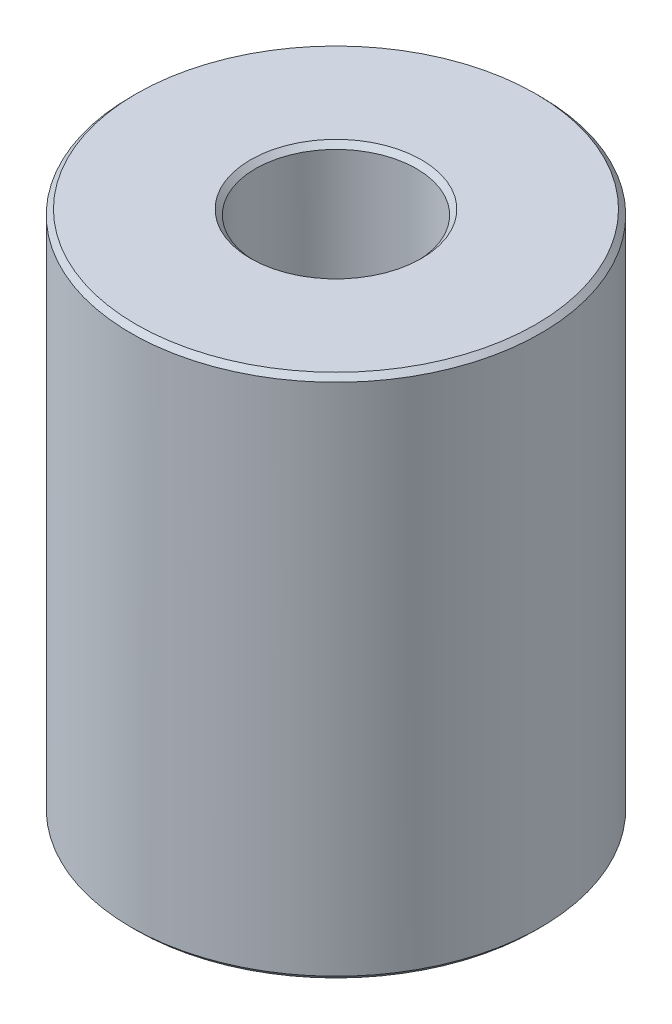
ISO-10303-21;
HEADER;
FILE_DESCRIPTION(('STEP AP214'),'2;1');
FILE_NAME('part.step','',(''),(''),'','','');
FILE_SCHEMA(('AUTOMOTIVE_DESIGN { 1 0 10303 214 1 1 1 1 }'));
ENDSEC;
DATA;
#1=APPLICATION_CONTEXT('core data for automotive mechanical design processes');
#2=APPLICATION_PROTOCOL_DEFINITION('international standard','automotive_design',2000,#1);
#3=PRODUCT_CONTEXT('',#1,'mechanical');
#4=PRODUCT('Part','Part','',(#3));
#5=PRODUCT_RELATED_PRODUCT_CATEGORY('part','',(#4));
#6=PRODUCT_DEFINITION_FORMATION('','',#4);
#7=PRODUCT_DEFINITION_CONTEXT('part definition',#1,'design');
#8=PRODUCT_DEFINITION('design','',#6,#7);
#9=PRODUCT_DEFINITION_SHAPE('','',#8);
#10=(LENGTH_UNIT() NAMED_UNIT(*) SI_UNIT(.MILLI.,.METRE.));
#11=(NAMED_UNIT(*) PLANE_ANGLE_UNIT() SI_UNIT($,.RADIAN.));
#12=(NAMED_UNIT(*) SI_UNIT($,.STERADIAN.) SOLID_ANGLE_UNIT());
#13=UNCERTAINTY_MEASURE_WITH_UNIT(LENGTH_MEASURE(1.E-05),#10,'distance_accuracy_value','');
#14=(GEOMETRIC_REPRESENTATION_CONTEXT(3) GLOBAL_UNCERTAINTY_ASSIGNED_CONTEXT((#13)) GLOBAL_UNIT_ASSIGNED_CONTEXT((#10,
#11,#12)) REPRESENTATION_CONTEXT('',''));
#15=CARTESIAN_POINT('',(0.,0.,0.));
#16=DIRECTION('',(0.,0.,1.));
#17=DIRECTION('',(1.,0.,0.));
#18=AXIS2_PLACEMENT_3D('',#15,#16,#17);
#19=CARTESIAN_POINT('',(0.,147.217348148467,0.));
#20=DIRECTION('',(0.,-1.,0.));
#21=DIRECTION('',(0.,0.,-1.));
#22=AXIS2_PLACEMENT_3D('',#19,#20,#21);
#23=CYLINDRICAL_SURFACE('',#22,57.5);
#24=CARTESIAN_POINT('',(0.,1.43097935988024,0.));
#25=DIRECTION('',(0.,1.,0.));
#26=DIRECTION('',(0.,0.,1.));
#27=AXIS2_PLACEMENT_3D('',#24,#25,#26);
#28=CIRCLE('',#27,57.5);
#29=CARTESIAN_POINT('',(0.,1.43097935988024,57.5));
#30=VERTEX_POINT('',#29);
#31=EDGE_CURVE('E10',#30,#30,#28,.T.);
#32=ORIENTED_EDGE('',*,*,#31,.T.);
#33=EDGE_LOOP('',(#32));
#34=FACE_BOUND('',#33,.T.);
#35=CARTESIAN_POINT('',(0.,145.786368788587,0.));
#36=DIRECTION('',(0.,1.,0.));
#37=DIRECTION('',(0.,0.,1.));
#38=AXIS2_PLACEMENT_3D('',#35,#36,#37);
#39=CIRCLE('',#38,57.5);
#40=CARTESIAN_POINT('',(0.,145.786368788587,-57.5));
#41=VERTEX_POINT('',#40);
#42=EDGE_CURVE('E50',#41,#41,#39,.F.);
#43=ORIENTED_EDGE('',*,*,#42,.T.);
#44=EDGE_LOOP('',(#43));
#45=FACE_BOUND('',#44,.T.);
#46=ADVANCED_FACE('F39',(#34,#45),#23,.T.);
#47=CARTESIAN_POINT('',(0.,147.217348148467,0.));
#48=DIRECTION('',(0.,1.,0.));
#49=DIRECTION('',(0.,0.,1.));
#50=AXIS2_PLACEMENT_3D('',#47,#48,#49);
#51=PLANE('',#50);
#52=CARTESIAN_POINT('',(0.,147.217348148467,0.));
#53=DIRECTION('',(0.,1.,0.));
#54=DIRECTION('',(0.,0.,1.));
#55=AXIS2_PLACEMENT_3D('',#52,#53,#54);
#56=CIRCLE('',#55,23.9984481929716);
#57=CARTESIAN_POINT('',(0.,147.217348148467,23.9984481929716));
#58=VERTEX_POINT('',#57);
#59=EDGE_CURVE('E58',#58,#58,#56,.F.);
#60=ORIENTED_EDGE('',*,*,#59,.T.);
#61=EDGE_LOOP('',(#60));
#62=FACE_BOUND('',#61,.T.);
#63=CARTESIAN_POINT('',(0.,147.217348148467,0.));
#64=DIRECTION('',(0.,1.,0.));
#65=DIRECTION('',(0.,0.,1.));
#66=AXIS2_PLACEMENT_3D('',#63,#64,#65);
#67=CIRCLE('',#66,56.0690206401197);
#68=CARTESIAN_POINT('',(0.,147.217348148467,-56.0690206401197));
#69=VERTEX_POINT('',#68);
#70=EDGE_CURVE('E61',#69,#69,#67,.T.);
#71=ORIENTED_EDGE('',*,*,#70,.T.);
#72=EDGE_LOOP('',(#71));
#73=FACE_BOUND('',#72,.T.);
#74=ADVANCED_FACE('F88',(#62,#73),#51,.T.);
#75=CARTESIAN_POINT('',(0.,0.,0.));
#76=DIRECTION('',(0.,1.,0.));
#77=DIRECTION('',(0.,0.,1.));
#78=AXIS2_PLACEMENT_3D('',#75,#76,#77);
#79=PLANE('',#78);
#80=CARTESIAN_POINT('',(0.,0.,0.));
#81=DIRECTION('',(0.,1.,0.));
#82=DIRECTION('',(0.,0.,1.));
#83=AXIS2_PLACEMENT_3D('',#80,#81,#82);
#84=CIRCLE('',#83,23.9984481929716);
#85=CARTESIAN_POINT('',(0.,0.,-23.9984481929716));
#86=VERTEX_POINT('',#85);
#87=EDGE_CURVE('E51',#86,#86,#84,.T.);
#88=ORIENTED_EDGE('',*,*,#87,.T.);
#89=EDGE_LOOP('',(#88));
#90=FACE_BOUND('',#89,.T.);
#91=CARTESIAN_POINT('',(0.,0.,0.));
#92=DIRECTION('',(0.,1.,0.));
#93=DIRECTION('',(0.,0.,1.));
#94=AXIS2_PLACEMENT_3D('',#91,#92,#93);
#95=CIRCLE('',#94,56.0690206401198);
#96=CARTESIAN_POINT('',(0.,0.,56.0690206401198));
#97=VERTEX_POINT('',#96);
#98=EDGE_CURVE('E54',#97,#97,#95,.F.);
#99=ORIENTED_EDGE('',*,*,#98,.T.);
#100=EDGE_LOOP('',(#99));
#101=FACE_BOUND('',#100,.T.);
#102=ADVANCED_FACE('F83',(#90,#101),#79,.F.);
#103=CARTESIAN_POINT('',(0.,147.217348148467,0.));
#104=DIRECTION('',(0.,-1.,0.));
#105=DIRECTION('',(0.,0.,-1.));
#106=AXIS2_PLACEMENT_3D('',#103,#104,#105);
#107=CYLINDRICAL_SURFACE('',#106,22.5674688330913);
#108=CARTESIAN_POINT('',(0.,145.786368788587,0.));
#109=DIRECTION('',(0.,1.,0.));
#110=DIRECTION('',(0.,0.,1.));
#111=AXIS2_PLACEMENT_3D('',#108,#109,#110);
#112=CIRCLE('',#111,22.5674688330913);
#113=CARTESIAN_POINT('',(0.,145.786368788587,22.5674688330913));
#114=VERTEX_POINT('',#113);
#115=EDGE_CURVE('E67',#114,#114,#112,.T.);
#116=ORIENTED_EDGE('',*,*,#115,.T.);
#117=EDGE_LOOP('',(#116));
#118=FACE_BOUND('',#117,.T.);
#119=CARTESIAN_POINT('',(0.,1.43097935988026,0.));
#120=DIRECTION('',(0.,1.,0.));
#121=DIRECTION('',(0.,0.,1.));
#122=AXIS2_PLACEMENT_3D('',#119,#120,#121);
#123=CIRCLE('',#122,22.5674688330913);
#124=CARTESIAN_POINT('',(0.,1.43097935988026,-22.5674688330913));
#125=VERTEX_POINT('',#124);
#126=EDGE_CURVE('E69',#125,#125,#123,.F.);
#127=ORIENTED_EDGE('',*,*,#126,.T.);
#128=EDGE_LOOP('',(#127));
#129=FACE_BOUND('',#128,.T.);
#130=ADVANCED_FACE('F71',(#118,#129),#107,.F.);
#131=CARTESIAN_POINT('',(0.,145.786368788587,0.));
#132=DIRECTION('',(0.,1.,0.));
#133=DIRECTION('',(0.,0.,1.));
#134=AXIS2_PLACEMENT_3D('',#131,#132,#133);
#135=CONICAL_SURFACE('',#134,22.5674688330913,0.785398163397448);
#136=ORIENTED_EDGE('',*,*,#59,.F.);
#137=EDGE_LOOP('',(#136));
#138=FACE_BOUND('',#137,.T.);
#139=ORIENTED_EDGE('',*,*,#115,.F.);
#140=EDGE_LOOP('',(#139));
#141=FACE_BOUND('',#140,.T.);
#142=ADVANCED_FACE('F77',(#138,#141),#135,.F.);
#143=CARTESIAN_POINT('',(0.,0.,0.));
#144=DIRECTION('',(0.,-1.,0.));
#145=DIRECTION('',(0.,0.,-1.));
#146=AXIS2_PLACEMENT_3D('',#143,#144,#145);
#147=CONICAL_SURFACE('',#146,23.9984481929716,0.78539816339745);
#148=CARTESIAN_POINT('',(0.,1.43097935988026,-22.5674688330913));
#149=CARTESIAN_POINT('',(0.,1.41607332488151,-22.58237486809));
#150=CARTESIAN_POINT('',(0.,1.40116728988276,-22.5972809030888));
#151=CARTESIAN_POINT('',(0.,1.37135521988525,-22.6270929730863));
#152=CARTESIAN_POINT('',(0.,1.3564491848865,-22.6419990080851));
#153=CARTESIAN_POINT('',(0.,1.32663711488899,-22.6718110780826));
#154=CARTESIAN_POINT('',(0.,1.31173107989024,-22.6867171130813));
#155=CARTESIAN_POINT('',(0.,1.28191900989274,-22.7165291830788));
#156=CARTESIAN_POINT('',(0.,1.26701297489398,-22.7314352180776));
#157=CARTESIAN_POINT('',(0.,1.23720090489648,-22.7612472880751));
#158=CARTESIAN_POINT('',(0.,1.22229486989772,-22.7761533230738));
#159=CARTESIAN_POINT('',(0.,1.19248279990022,-22.8059653930713));
#160=CARTESIAN_POINT('',(0.,1.17757676490147,-22.8208714280701));
#161=CARTESIAN_POINT('',(0.,1.14776469490396,-22.8506834980676));
#162=CARTESIAN_POINT('',(0.,1.13285865990521,-22.8655895330664));
#163=CARTESIAN_POINT('',(0.,1.1030465899077,-22.8954016030639));
#164=CARTESIAN_POINT('',(0.,1.08814055490895,-22.9103076380626));
#165=CARTESIAN_POINT('',(0.,1.05832848491144,-22.9401197080601));
#166=CARTESIAN_POINT('',(0.,1.04342244991269,-22.9550257430589));
#167=CARTESIAN_POINT('',(0.,1.01361037991519,-22.9848378130564));
#168=CARTESIAN_POINT('',(0.,0.998704344916434,-22.9997438480551));
#169=CARTESIAN_POINT('',(0.,0.968892274918928,-23.0295559180526));
#170=CARTESIAN_POINT('',(0.,0.953986239920176,-23.0444619530514));
#171=CARTESIAN_POINT('',(0.,0.92417416992267,-23.0742740230489));
#172=CARTESIAN_POINT('',(0.,0.909268134923917,-23.0891800580476));
#173=CARTESIAN_POINT('',(0.,0.879456064926411,-23.1189921280452));
#174=CARTESIAN_POINT('',(0.,0.864550029927659,-23.1338981630439));
#175=CARTESIAN_POINT('',(0.,0.834737959930154,-23.1637102330414));
#176=CARTESIAN_POINT('',(0.,0.819831924931401,-23.1786162680402));
#177=CARTESIAN_POINT('',(0.,0.790019854933895,-23.2084283380377));
#178=CARTESIAN_POINT('',(0.,0.775113819935143,-23.2233343730364));
#179=CARTESIAN_POINT('',(0.,0.745301749937637,-23.2531464430339));
#180=CARTESIAN_POINT('',(0.,0.730395714938884,-23.2680524780327));
#181=CARTESIAN_POINT('',(0.,0.700583644941379,-23.2978645480302));
#182=CARTESIAN_POINT('',(0.,0.685677609942626,-23.3127705830289));
#183=CARTESIAN_POINT('',(0.,0.655865539945121,-23.3425826530264));
#184=CARTESIAN_POINT('',(0.,0.640959504946368,-23.3574886880252));
#185=CARTESIAN_POINT('',(0.,0.611147434948862,-23.3873007580227));
#186=CARTESIAN_POINT('',(0.,0.596241399950109,-23.4022067930215));
#187=CARTESIAN_POINT('',(0.,0.566429329952604,-23.432018863019));
#188=CARTESIAN_POINT('',(0.,0.551523294953852,-23.4469248980177));
#189=CARTESIAN_POINT('',(0.,0.521711224956346,-23.4767369680152));
#190=CARTESIAN_POINT('',(0.,0.506805189957593,-23.491643003014));
#191=CARTESIAN_POINT('',(0.,0.476993119960088,-23.5214550730115));
#192=CARTESIAN_POINT('',(0.,0.462087084961335,-23.5363611080102));
#193=CARTESIAN_POINT('',(0.,0.432275014963829,-23.5661731780077));
#194=CARTESIAN_POINT('',(0.,0.417368979965076,-23.5810792130065));
#195=CARTESIAN_POINT('',(0.,0.387556909967571,-23.610891283004));
#196=CARTESIAN_POINT('',(0.,0.372650874968819,-23.6257973180027));
#197=CARTESIAN_POINT('',(0.,0.342838804971313,-23.6556093880003));
#198=CARTESIAN_POINT('',(0.,0.32793276997256,-23.670515422999));
#199=CARTESIAN_POINT('',(0.,0.298120699975055,-23.7003274929965));
#200=CARTESIAN_POINT('',(0.,0.283214664976302,-23.7152335279953));
#201=CARTESIAN_POINT('',(0.,0.253402594978796,-23.7450455979928));
#202=CARTESIAN_POINT('',(0.,0.238496559980044,-23.7599516329915));
#203=CARTESIAN_POINT('',(0.,0.208684489982539,-23.789763702989));
#204=CARTESIAN_POINT('',(0.,0.193778454983786,-23.8046697379878));
#205=CARTESIAN_POINT('',(0.,0.16396638498628,-23.8344818079853));
#206=CARTESIAN_POINT('',(0.,0.149060349987527,-23.849387842984));
#207=CARTESIAN_POINT('',(0.,0.119248279990022,-23.8791999129815));
#208=CARTESIAN_POINT('',(0.,0.104342244991269,-23.8941059479803));
#209=CARTESIAN_POINT('',(0.,0.0745301749937634,-23.9239180179778));
#210=CARTESIAN_POINT('',(0.,0.059624139995011,-23.9388240529766));
#211=CARTESIAN_POINT('',(0.,0.0298120699975061,-23.9686361229741));
#212=CARTESIAN_POINT('',(0.,0.0149060349987536,-23.9835421579728));
#213=CARTESIAN_POINT('',(0.,0.,-23.9984481929716));
#214=B_SPLINE_CURVE_WITH_KNOTS('',3,(#148,#149,#150,#151,#152,#153,#154,#155,#156,#157,#158,
#159,#160,#161,#162,#163,#164,#165,#166,#167,#168,#169,#170,#171,#172,#173,#174,#175,#176,#177,
#178,#179,#180,#181,#182,#183,#184,#185,#186,#187,#188,#189,#190,#191,#192,#193,#194,#195,#196,
#197,#198,#199,#200,#201,#202,#203,#204,#205,#206,#207,#208,#209,#210,#211,#212,#213),
.UNSPECIFIED.,.F.,.F.,(4,2,2,2,2,2,2,2,2,2,2,2,2,2,2,2,2,2,2,2,2,2,2,2,2,2,2,2,2,2,2,2,4),(0.,
0.0632409505693318,0.126481901138666,0.189722851707998,0.25296380227733,0.316204752846662,
0.379445703415996,0.442686653985328,0.50592760455466,0.569168555123994,0.632409505693326,
0.695650456262658,0.758891406831989,0.822132357401324,0.885373307970655,0.948614258539987,
1.01185520910932,1.07509615967865,1.13833711024799,1.20157806081732,1.26481901138665,
1.32805996195598,1.39130091252531,1.45454186309465,1.51778281366398,1.58102376423331,
1.64426471480264,1.70750566537198,1.77074661594131,1.83398756651064,1.89722851707997,
1.96046946764931,2.02371041821864),.UNSPECIFIED.);
#215=EDGE_CURVE('BSEAM73',#125,#86,#214,.T.);
#216=ORIENTED_EDGE('',*,*,#126,.F.);
#217=ORIENTED_EDGE('',*,*,#87,.F.);
#218=ORIENTED_EDGE('',*,*,#215,.T.);
#219=ORIENTED_EDGE('',*,*,#215,.F.);
#220=EDGE_LOOP('',(#216,#218,#217,#219));
#221=FACE_BOUND('',#220,.T.);
#222=ADVANCED_FACE('F73',(#221),#147,.F.);
#223=CARTESIAN_POINT('',(0.,1.43097935988024,0.));
#224=DIRECTION('',(0.,1.,0.));
#225=DIRECTION('',(0.,0.,1.));
#226=AXIS2_PLACEMENT_3D('',#223,#224,#225);
#227=CONICAL_SURFACE('',#226,57.5,0.785398163397443);
#228=ORIENTED_EDGE('',*,*,#98,.F.);
#229=EDGE_LOOP('',(#228));
#230=FACE_BOUND('',#229,.T.);
#231=ORIENTED_EDGE('',*,*,#31,.F.);
#232=EDGE_LOOP('',(#231));
#233=FACE_BOUND('',#232,.T.);
#234=ADVANCED_FACE('F76',(#230,#233),#227,.T.);
#235=CARTESIAN_POINT('',(0.,147.217348148467,0.));
#236=DIRECTION('',(0.,-1.,0.));
#237=DIRECTION('',(0.,0.,-1.));
#238=AXIS2_PLACEMENT_3D('',#235,#236,#237);
#239=CONICAL_SURFACE('',#238,56.0690206401197,0.785398163397451);
#240=CARTESIAN_POINT('',(0.,145.786368788587,-57.5));
#241=CARTESIAN_POINT('',(0.,145.801274823585,-57.4850939650013));
#242=CARTESIAN_POINT('',(0.,145.816180858584,-57.4701879300025));
#243=CARTESIAN_POINT('',(0.,145.845992928582,-57.440375860005));
#244=CARTESIAN_POINT('',(0.,145.86089896358,-57.4254698250063));
#245=CARTESIAN_POINT('',(0.,145.890711033578,-57.3956577550087));
#246=CARTESIAN_POINT('',(0.,145.905617068577,-57.38075172001));
#247=CARTESIAN_POINT('',(0.,145.935429138574,-57.3509396500125));
#248=CARTESIAN_POINT('',(0.,145.950335173573,-57.3360336150137));
#249=CARTESIAN_POINT('',(0.,145.980147243571,-57.3062215450162));
#250=CARTESIAN_POINT('',(0.,145.995053278569,-57.2913155100175));
#251=CARTESIAN_POINT('',(0.,146.024865348567,-57.26150344002));
#252=CARTESIAN_POINT('',(0.,146.039771383565,-57.2465974050212));
#253=CARTESIAN_POINT('',(0.,146.069583453563,-57.2167853350237));
#254=CARTESIAN_POINT('',(0.,146.084489488562,-57.201879300025));
#255=CARTESIAN_POINT('',(0.,146.114301558559,-57.1720672300275));
#256=CARTESIAN_POINT('',(0.,146.129207593558,-57.1571611950287));
#257=CARTESIAN_POINT('',(0.,146.159019663556,-57.1273491250312));
#258=CARTESIAN_POINT('',(0.,146.173925698554,-57.1124430900324));
#259=CARTESIAN_POINT('',(0.,146.203737768552,-57.0826310200349));
#260=CARTESIAN_POINT('',(0.,146.218643803551,-57.0677249850362));
#261=CARTESIAN_POINT('',(0.,146.248455873548,-57.0379129150387));
#262=CARTESIAN_POINT('',(0.,146.263361908547,-57.0230068800399));
#263=CARTESIAN_POINT('',(0.,146.293173978544,-56.9931948100424));
#264=CARTESIAN_POINT('',(0.,146.308080013543,-56.9782887750437));
#265=CARTESIAN_POINT('',(0.,146.337892083541,-56.9484767050462));
#266=CARTESIAN_POINT('',(0.,146.352798118539,-56.9335706700474));
#267=CARTESIAN_POINT('',(0.,146.382610188537,-56.9037586000499));
#268=CARTESIAN_POINT('',(0.,146.397516223536,-56.8888525650511));
#269=CARTESIAN_POINT('',(0.,146.427328293533,-56.8590404950536));
#270=CARTESIAN_POINT('',(0.,146.442234328532,-56.8441344600549));
#271=CARTESIAN_POINT('',(0.,146.472046398529,-56.8143223900574));
#272=CARTESIAN_POINT('',(0.,146.486952433528,-56.7994163550586));
#273=CARTESIAN_POINT('',(0.,146.516764503526,-56.7696042850611));
#274=CARTESIAN_POINT('',(0.,146.531670538524,-56.7546982500624));
#275=CARTESIAN_POINT('',(0.,146.561482608522,-56.7248861800649));
#276=CARTESIAN_POINT('',(0.,146.576388643521,-56.7099801450661));
#277=CARTESIAN_POINT('',(0.,146.606200713518,-56.6801680750686));
#278=CARTESIAN_POINT('',(0.,146.621106748517,-56.6652620400699));
#279=CARTESIAN_POINT('',(0.,146.650918818514,-56.6354499700724));
#280=CARTESIAN_POINT('',(0.,146.665824853513,-56.6205439350736));
#281=CARTESIAN_POINT('',(0.,146.695636923511,-56.5907318650761));
#282=CARTESIAN_POINT('',(0.,146.710542958509,-56.5758258300773));
#283=CARTESIAN_POINT('',(0.,146.740355028507,-56.5460137600798));
#284=CARTESIAN_POINT('',(0.,146.755261063506,-56.5311077250811));
#285=CARTESIAN_POINT('',(0.,146.785073133503,-56.5012956550836));
#286=CARTESIAN_POINT('',(0.,146.799979168502,-56.4863896200848));
#287=CARTESIAN_POINT('',(0.,146.829791238499,-56.4565775500873));
#288=CARTESIAN_POINT('',(0.,146.844697273498,-56.4416715150886));
#289=CARTESIAN_POINT('',(0.,146.874509343496,-56.4118594450911));
#290=CARTESIAN_POINT('',(0.,146.889415378494,-56.3969534100923));
#291=CARTESIAN_POINT('',(0.,146.919227448492,-56.3671413400948));
#292=CARTESIAN_POINT('',(0.,146.934133483491,-56.3522353050961));
#293=CARTESIAN_POINT('',(0.,146.963945553488,-56.3224232350985));
#294=CARTESIAN_POINT('',(0.,146.978851588487,-56.3075172000998));
#295=CARTESIAN_POINT('',(0.,147.008663658484,-56.2777051301023));
#296=CARTESIAN_POINT('',(0.,147.023569693483,-56.2627990951035));
#297=CARTESIAN_POINT('',(0.,147.053381763481,-56.232987025106));
#298=CARTESIAN_POINT('',(0.,147.068287798479,-56.2180809901073));
#299=CARTESIAN_POINT('',(0.,147.098099868477,-56.1882689201098));
#300=CARTESIAN_POINT('',(0.,147.113005903476,-56.173362885111));
#301=CARTESIAN_POINT('',(0.,147.142817973473,-56.1435508151135));
#302=CARTESIAN_POINT('',(0.,147.157724008472,-56.1286447801148));
#303=CARTESIAN_POINT('',(0.,147.187536078469,-56.0988327101173));
#304=CARTESIAN_POINT('',(0.,147.202442113468,-56.0839266751185));
#305=CARTESIAN_POINT('',(0.,147.217348148467,-56.0690206401197));
#306=B_SPLINE_CURVE_WITH_KNOTS('',3,(#240,#241,#242,#243,#244,#245,#246,#247,#248,#249,#250,
#251,#252,#253,#254,#255,#256,#257,#258,#259,#260,#261,#262,#263,#264,#265,#266,#267,#268,#269,
#270,#271,#272,#273,#274,#275,#276,#277,#278,#279,#280,#281,#282,#283,#284,#285,#286,#287,#288,
#289,#290,#291,#292,#293,#294,#295,#296,#297,#298,#299,#300,#301,#302,#303,#304,#305),
.UNSPECIFIED.,.F.,.F.,(4,2,2,2,2,2,2,2,2,2,2,2,2,2,2,2,2,2,2,2,2,2,2,2,2,2,2,2,2,2,2,2,4),(0.,
0.0632409505693165,0.126481901138648,0.189722851707984,0.25296380227732,0.316204752846651,
0.379445703415987,0.442686653985324,0.505927604554655,0.569168555123991,0.632409505693327,
0.695650456262639,0.758891406831975,0.822132357401311,0.885373307970642,0.948614258539978,
1.01185520910931,1.07509615967865,1.13833711024798,1.20157806081731,1.26481901138665,
1.32805996195598,1.3913009125253,1.45454186309463,1.51778281366397,1.5810237642333,
1.64426471480264,1.70750566537197,1.7707466159413,1.83398756651064,1.89722851707998,
1.96046946764931,2.02371041821864),.UNSPECIFIED.);
#307=EDGE_CURVE('BSEAM45',#41,#69,#306,.T.);
#308=ORIENTED_EDGE('',*,*,#42,.F.);
#309=ORIENTED_EDGE('',*,*,#70,.F.);
#310=ORIENTED_EDGE('',*,*,#307,.T.);
#311=ORIENTED_EDGE('',*,*,#307,.F.);
#312=EDGE_LOOP('',(#308,#310,#309,#311));
#313=FACE_BOUND('',#312,.T.);
#314=ADVANCED_FACE('F45',(#313),#239,.T.);
#315=CLOSED_SHELL('',(#46,#74,#102,#130,#142,#222,#234,#314));
#316=MANIFOLD_SOLID_BREP('B2',#315);
#317=ADVANCED_BREP_SHAPE_REPRESENTATION('',(#18,#316),#14);
#318=SHAPE_DEFINITION_REPRESENTATION(#9,#317);
ENDSEC;
END-ISO-10303-21;
